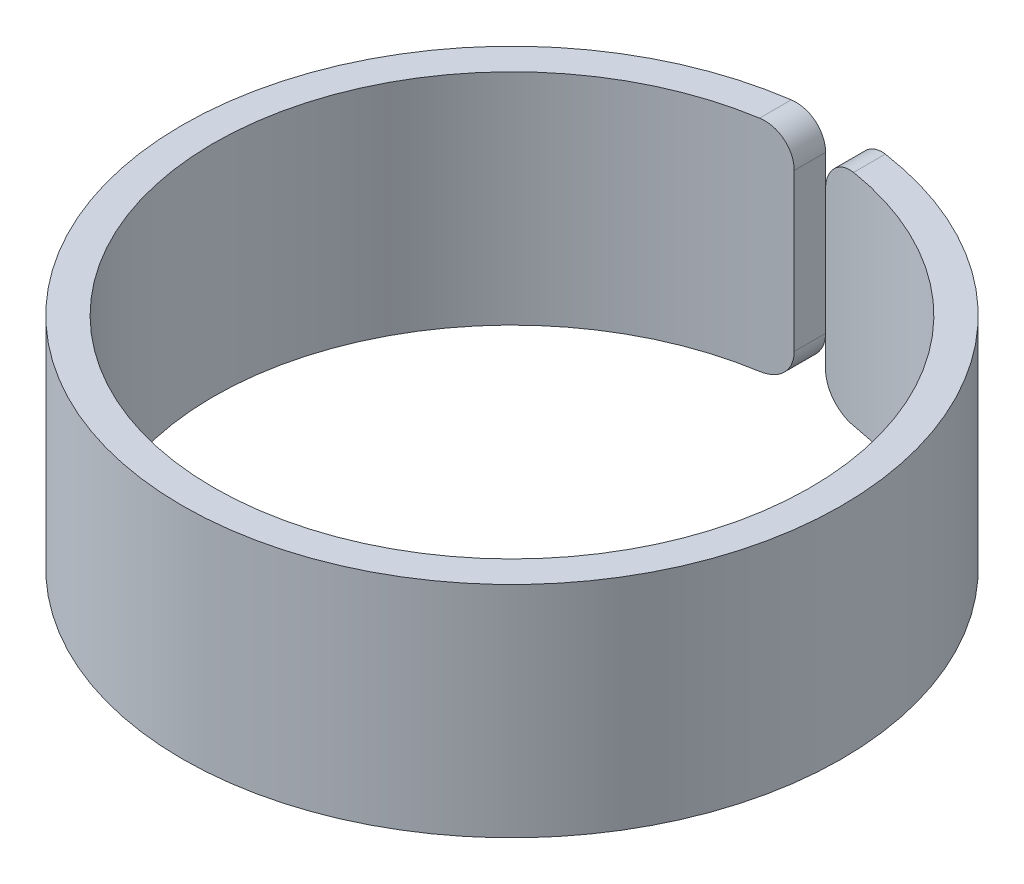
ISO-10303-21;
HEADER;
FILE_DESCRIPTION(('STEP AP214'),'2;1');
FILE_NAME('part.step','',(''),(''),'','','');
FILE_SCHEMA(('AUTOMOTIVE_DESIGN { 1 0 10303 214 1 1 1 1 }'));
ENDSEC;
DATA;
#1=APPLICATION_CONTEXT('core data for automotive mechanical design processes');
#2=APPLICATION_PROTOCOL_DEFINITION('international standard','automotive_design',2000,#1);
#3=PRODUCT_CONTEXT('',#1,'mechanical');
#4=PRODUCT('Part','Part','',(#3));
#5=PRODUCT_RELATED_PRODUCT_CATEGORY('part','',(#4));
#6=PRODUCT_DEFINITION_FORMATION('','',#4);
#7=PRODUCT_DEFINITION_CONTEXT('part definition',#1,'design');
#8=PRODUCT_DEFINITION('design','',#6,#7);
#9=PRODUCT_DEFINITION_SHAPE('','',#8);
#10=(LENGTH_UNIT() NAMED_UNIT(*) SI_UNIT(.MILLI.,.METRE.));
#11=(NAMED_UNIT(*) PLANE_ANGLE_UNIT() SI_UNIT($,.RADIAN.));
#12=(NAMED_UNIT(*) SI_UNIT($,.STERADIAN.) SOLID_ANGLE_UNIT());
#13=UNCERTAINTY_MEASURE_WITH_UNIT(LENGTH_MEASURE(1.E-05),#10,'distance_accuracy_value','');
#14=(GEOMETRIC_REPRESENTATION_CONTEXT(3) GLOBAL_UNCERTAINTY_ASSIGNED_CONTEXT((#13)) GLOBAL_UNIT_ASSIGNED_CONTEXT((#10,
#11,#12)) REPRESENTATION_CONTEXT('',''));
#15=CARTESIAN_POINT('',(0.,0.,0.));
#16=DIRECTION('',(0.,0.,1.));
#17=DIRECTION('',(1.,0.,0.));
#18=AXIS2_PLACEMENT_3D('',#15,#16,#17);
#19=CARTESIAN_POINT('',(0.,3.5,0.));
#20=DIRECTION('',(0.,1.,0.));
#21=DIRECTION('',(0.,0.,1.));
#22=AXIS2_PLACEMENT_3D('',#19,#20,#21);
#23=PLANE('',#22);
#24=CARTESIAN_POINT('',(0.,3.5,0.));
#25=DIRECTION('',(0.,1.,0.));
#26=DIRECTION('',(1.,0.,0.));
#27=AXIS2_PLACEMENT_3D('',#24,#25,#26);
#28=CIRCLE('',#27,10.52);
#29=CARTESIAN_POINT('',(-1.50000000000031,3.5,-10.4125117046752));
#30=VERTEX_POINT('',#29);
#31=CARTESIAN_POINT('',(1.5000000000003,3.5,-10.4125117046753));
#32=VERTEX_POINT('',#31);
#33=EDGE_CURVE('E212',#30,#32,#28,.T.);
#34=ORIENTED_EDGE('',*,*,#33,.T.);
#35=DIRECTION('',(0.,0.,-1.));
#36=VECTOR('',#35,1.);
#37=CARTESIAN_POINT('',(1.5000000000003,3.5,-9.50686068058219));
#38=LINE('',#37,#36);
#39=CARTESIAN_POINT('',(1.5000000000003,3.5,-9.40108504375953));
#40=VERTEX_POINT('',#39);
#41=EDGE_CURVE('E130',#32,#40,#38,.F.);
#42=ORIENTED_EDGE('',*,*,#41,.T.);
#43=CARTESIAN_POINT('',(0.,3.5,0.));
#44=DIRECTION('',(0.,1.,0.));
#45=DIRECTION('',(0.,0.,1.));
#46=AXIS2_PLACEMENT_3D('',#43,#44,#45);
#47=CIRCLE('',#46,9.52);
#48=CARTESIAN_POINT('',(-1.50000000000031,3.5,-9.40108504375953));
#49=VERTEX_POINT('',#48);
#50=EDGE_CURVE('E216',#49,#40,#47,.T.);
#51=ORIENTED_EDGE('',*,*,#50,.F.);
#52=DIRECTION('',(0.,0.,1.));
#53=VECTOR('',#52,1.);
#54=CARTESIAN_POINT('',(-1.50000000000031,3.5,-10.508111152819));
#55=LINE('',#54,#53);
#56=EDGE_CURVE('E133',#49,#30,#55,.F.);
#57=ORIENTED_EDGE('',*,*,#56,.T.);
#58=EDGE_LOOP('',(#34,#42,#51,#57));
#59=FACE_BOUND('',#58,.T.);
#60=ADVANCED_FACE('F39',(#59),#23,.T.);
#61=CARTESIAN_POINT('',(0.,-3.5,0.));
#62=DIRECTION('',(0.,1.,0.));
#63=DIRECTION('',(0.,0.,1.));
#64=AXIS2_PLACEMENT_3D('',#61,#62,#63);
#65=PLANE('',#64);
#66=CARTESIAN_POINT('',(0.,-3.5,0.));
#67=DIRECTION('',(0.,1.,0.));
#68=DIRECTION('',(1.,0.,0.));
#69=AXIS2_PLACEMENT_3D('',#66,#67,#68);
#70=CIRCLE('',#69,10.52);
#71=CARTESIAN_POINT('',(-1.50000000000031,-3.5,-10.4125117046752));
#72=VERTEX_POINT('',#71);
#73=CARTESIAN_POINT('',(1.5000000000003,-3.5,-10.4125117046753));
#74=VERTEX_POINT('',#73);
#75=EDGE_CURVE('E213',#72,#74,#70,.T.);
#76=ORIENTED_EDGE('',*,*,#75,.F.);
#77=DIRECTION('',(0.,0.,1.));
#78=VECTOR('',#77,1.);
#79=CARTESIAN_POINT('',(-1.50000000000031,-3.5,0.));
#80=LINE('',#79,#78);
#81=CARTESIAN_POINT('',(-1.50000000000031,-3.5,-9.40108504375953));
#82=VERTEX_POINT('',#81);
#83=EDGE_CURVE('E12',#72,#82,#80,.T.);
#84=ORIENTED_EDGE('',*,*,#83,.T.);
#85=CARTESIAN_POINT('',(0.,-3.5,0.));
#86=DIRECTION('',(0.,1.,0.));
#87=DIRECTION('',(0.,0.,1.));
#88=AXIS2_PLACEMENT_3D('',#85,#86,#87);
#89=CIRCLE('',#88,9.52);
#90=CARTESIAN_POINT('',(1.5000000000003,-3.5,-9.40108504375953));
#91=VERTEX_POINT('',#90);
#92=EDGE_CURVE('E219',#82,#91,#89,.T.);
#93=ORIENTED_EDGE('',*,*,#92,.T.);
#94=DIRECTION('',(0.,0.,-1.));
#95=VECTOR('',#94,1.);
#96=CARTESIAN_POINT('',(1.50000000000031,-3.5,0.));
#97=LINE('',#96,#95);
#98=EDGE_CURVE('E48',#91,#74,#97,.T.);
#99=ORIENTED_EDGE('',*,*,#98,.T.);
#100=EDGE_LOOP('',(#76,#84,#93,#99));
#101=FACE_BOUND('',#100,.T.);
#102=ADVANCED_FACE('F199',(#101),#65,.F.);
#103=CARTESIAN_POINT('',(0.,3.5,0.));
#104=DIRECTION('',(0.,-1.,0.));
#105=DIRECTION('',(0.,0.,-1.));
#106=AXIS2_PLACEMENT_3D('',#103,#104,#105);
#107=CYLINDRICAL_SURFACE('',#106,10.52);
#108=DIRECTION('',(0.,-1.,0.));
#109=VECTOR('',#108,1.);
#110=CARTESIAN_POINT('',(0.5000000000003,3.5,-10.508111152819));
#111=LINE('',#110,#109);
#112=CARTESIAN_POINT('',(0.5000000000003,-2.5,-10.508111152819));
#113=VERTEX_POINT('',#112);
#114=CARTESIAN_POINT('',(0.5000000000003,2.5,-10.508111152819));
#115=VERTEX_POINT('',#114);
#116=EDGE_CURVE('E115',#113,#115,#111,.F.);
#117=ORIENTED_EDGE('',*,*,#116,.T.);
#118=CARTESIAN_POINT('',(0.5000000000003,2.5,-10.508111152819));
#119=CARTESIAN_POINT('',(0.500000173990326,2.52809536959546,-10.5081104957995));
#120=CARTESIAN_POINT('',(0.50118477079039,2.55617728696343,-10.5080548516909));
#121=CARTESIAN_POINT('',(0.505910520132688,2.61214033083627,-10.5078286433341));
#122=CARTESIAN_POINT('',(0.509451564700855,2.64002146648192,-10.5076580843515));
#123=CARTESIAN_POINT('',(0.523575752913995,2.72301658233977,-10.5069673600802));
#124=CARTESIAN_POINT('',(0.537660043740329,2.77757487707505,-10.5062681769172));
#125=CARTESIAN_POINT('',(0.574771226854076,2.88354863395968,-10.5043028925258));
#126=CARTESIAN_POINT('',(0.597802532849772,2.93496253041448,-10.5030365114421));
#127=CARTESIAN_POINT('',(0.652142880536923,3.03318464057714,-10.499802261567));
#128=CARTESIAN_POINT('',(0.683450415822341,3.07999369031538,-10.4978345204118));
#129=CARTESIAN_POINT('',(0.753421534574761,3.16765638102477,-10.4930444274093));
#130=CARTESIAN_POINT('',(0.792081571626897,3.2085128764478,-10.4902224871909));
#131=CARTESIAN_POINT('',(0.875652058716907,3.28315274296944,-10.4835769906622));
#132=CARTESIAN_POINT('',(0.920563424884361,3.31693507553193,-10.4797532874714));
#133=CARTESIAN_POINT('',(1.0153190059075,3.37647975816768,-10.4709975156382));
#134=CARTESIAN_POINT('',(1.06516339231255,3.40224182920129,-10.4660654084427));
#135=CARTESIAN_POINT('',(1.16833720494906,3.44504771725542,-10.4550501233979));
#136=CARTESIAN_POINT('',(1.22166511316152,3.46209530359082,-10.4489674447728));
#137=CARTESIAN_POINT('',(1.31274218081141,3.48303770009912,-10.4378390921893));
#138=CARTESIAN_POINT('',(1.3499802275045,3.48939993569244,-10.433089905788));
#139=CARTESIAN_POINT('',(1.4248179797192,3.4978806558238,-10.4231344616857));
#140=CARTESIAN_POINT('',(1.46241704982163,3.50000557316568,-10.417928909371));
#141=CARTESIAN_POINT('',(1.5000000000003,3.5,-10.4125117046753));
#142=B_SPLINE_CURVE_WITH_KNOTS('',3,(#118,#119,#120,#121,#122,#123,#124,#125,#126,#127,#128,
#129,#130,#131,#132,#133,#134,#135,#136,#137,#138,#139,#140,#141),.UNSPECIFIED.,.F.,.F.,(4,2,2,
2,2,2,2,2,2,2,2,4),(0.,0.0842343628520662,0.168464866293088,0.336651590809782,0.504921390154512,
0.673160582768882,0.841318831550482,1.00950174984776,1.1776905188846,1.34580647879851,
1.4598050602935,1.5736304448597),.UNSPECIFIED.);
#143=EDGE_CURVE('E186',#115,#32,#142,.T.);
#144=ORIENTED_EDGE('',*,*,#143,.T.);
#145=ORIENTED_EDGE('',*,*,#33,.F.);
#146=CARTESIAN_POINT('',(-1.50000000000031,3.5,-10.4125117046752));
#147=CARTESIAN_POINT('',(-1.47197265457512,3.49999973232898,-10.4165498820124));
#148=CARTESIAN_POINT('',(-1.44394159985791,3.49882092097969,-10.4204716754006));
#149=CARTESIAN_POINT('',(-1.38804366032391,3.49410934554469,-10.4280644719188));
#150=CARTESIAN_POINT('',(-1.36017677738775,3.49057655454644,-10.431735472181));
#151=CARTESIAN_POINT('',(-1.27715665719302,3.47646485907445,-10.4423354211473));
#152=CARTESIAN_POINT('',(-1.22250618779357,3.46237260530242,-10.4488624842294));
#153=CARTESIAN_POINT('',(-1.11622376238985,3.42514479316729,-10.4607511476611));
#154=CARTESIAN_POINT('',(-1.06459416203445,3.40200228274795,-10.4661118471167));
#155=CARTESIAN_POINT('',(-0.965898679891431,3.34729925560623,-10.4756812671342));
#156=CARTESIAN_POINT('',(-0.918831392157017,3.31574134353648,-10.47989034332));
#157=CARTESIAN_POINT('',(-0.830935285630264,3.24532135920653,-10.4872247799611));
#158=CARTESIAN_POINT('',(-0.790067869617737,3.20650814634923,-10.4903570132763));
#159=CARTESIAN_POINT('',(-0.71538926996337,3.12252971548472,-10.4957145296036));
#160=CARTESIAN_POINT('',(-0.681579622797911,3.07736311792037,-10.49793961523));
#161=CARTESIAN_POINT('',(-0.622085190865647,2.98209284935856,-10.5016331909484));
#162=CARTESIAN_POINT('',(-0.59638112446117,2.93200127242376,-10.5031034818715));
#163=CARTESIAN_POINT('',(-0.553736218454195,2.8282185376253,-10.5054383558279));
#164=CARTESIAN_POINT('',(-0.536790225121978,2.77452951775615,-10.5063032951896));
#165=CARTESIAN_POINT('',(-0.516332999567538,2.68376360545782,-10.5073244107504));
#166=CARTESIAN_POINT('',(-0.510211955242694,2.64725498778543,-10.5076216394351));
#167=CARTESIAN_POINT('',(-0.50204591392776,2.57383598672873,-10.5080138283005));
#168=CARTESIAN_POINT('',(-0.499995170382101,2.53692624384697,-10.5081090736594));
#169=CARTESIAN_POINT('',(-0.500000000000306,2.5,-10.508111152819));
#170=B_SPLINE_CURVE_WITH_KNOTS('',3,(#146,#147,#148,#149,#150,#151,#152,#153,#154,#155,#156,
#157,#158,#159,#160,#161,#162,#163,#164,#165,#166,#167,#168,#169),.UNSPECIFIED.,.F.,.F.,(4,2,2,
2,2,2,2,2,2,2,2,4),(0.,0.0848994596250283,0.169799889904256,0.339368051088577,0.509066724629099,
0.678712935539253,0.847255367679371,1.01583445333251,1.18400944222506,1.35208535474238,
1.4629315389816,1.57362111608515),.UNSPECIFIED.);
#171=CARTESIAN_POINT('',(-0.500000000000306,2.5,-10.508111152819));
#172=VERTEX_POINT('',#171);
#173=EDGE_CURVE('E179',#30,#172,#170,.T.);
#174=ORIENTED_EDGE('',*,*,#173,.T.);
#175=DIRECTION('',(0.,-1.,0.));
#176=VECTOR('',#175,1.);
#177=CARTESIAN_POINT('',(-0.500000000000306,3.5,-10.508111152819));
#178=LINE('',#177,#176);
#179=CARTESIAN_POINT('',(-0.500000000000306,-2.5,-10.508111152819));
#180=VERTEX_POINT('',#179);
#181=EDGE_CURVE('E223',#172,#180,#178,.T.);
#182=ORIENTED_EDGE('',*,*,#181,.T.);
#183=CARTESIAN_POINT('',(-0.500000000000306,-2.5,-10.508111152819));
#184=CARTESIAN_POINT('',(-0.500000173990332,-2.52809536959546,-10.5081104957995));
#185=CARTESIAN_POINT('',(-0.501184770790397,-2.55617728696343,-10.5080548516909));
#186=CARTESIAN_POINT('',(-0.505910520132695,-2.61214033083627,-10.5078286433341));
#187=CARTESIAN_POINT('',(-0.509451564700861,-2.64002146648192,-10.5076580843515));
#188=CARTESIAN_POINT('',(-0.523575752914001,-2.72301658233977,-10.5069673600802));
#189=CARTESIAN_POINT('',(-0.537660043740336,-2.77757487707505,-10.5062681769172));
#190=CARTESIAN_POINT('',(-0.574771226854082,-2.88354863395968,-10.5043028925258));
#191=CARTESIAN_POINT('',(-0.597802532849778,-2.93496253041448,-10.5030365114421));
#192=CARTESIAN_POINT('',(-0.65214288053693,-3.03318464057714,-10.499802261567));
#193=CARTESIAN_POINT('',(-0.683450415822347,-3.07999369031538,-10.4978345204118));
#194=CARTESIAN_POINT('',(-0.753421534574768,-3.16765638102477,-10.4930444274093));
#195=CARTESIAN_POINT('',(-0.792081571626903,-3.2085128764478,-10.4902224871909));
#196=CARTESIAN_POINT('',(-0.875652058716913,-3.28315274296944,-10.4835769906622));
#197=CARTESIAN_POINT('',(-0.920563424884367,-3.31693507553193,-10.4797532874714));
#198=CARTESIAN_POINT('',(-1.01531900590751,-3.37647975816768,-10.4709975156382));
#199=CARTESIAN_POINT('',(-1.06516339231256,-3.40224182920129,-10.4660654084427));
#200=CARTESIAN_POINT('',(-1.16833720494907,-3.44504771725542,-10.4550501233979));
#201=CARTESIAN_POINT('',(-1.22166511316153,-3.46209530359082,-10.4489674447728));
#202=CARTESIAN_POINT('',(-1.31274218081142,-3.48303770009912,-10.4378390921893));
#203=CARTESIAN_POINT('',(-1.34998022750451,-3.48939993569244,-10.433089905788));
#204=CARTESIAN_POINT('',(-1.4248179797192,-3.4978806558238,-10.4231344616857));
#205=CARTESIAN_POINT('',(-1.46241704982164,-3.50000557316568,-10.417928909371));
#206=CARTESIAN_POINT('',(-1.50000000000031,-3.5,-10.4125117046752));
#207=B_SPLINE_CURVE_WITH_KNOTS('',3,(#183,#184,#185,#186,#187,#188,#189,#190,#191,#192,#193,
#194,#195,#196,#197,#198,#199,#200,#201,#202,#203,#204,#205,#206),.UNSPECIFIED.,.F.,.F.,(4,2,2,
2,2,2,2,2,2,2,2,4),(0.,0.0842343628520662,0.168464866293088,0.336651590809782,0.504921390154512,
0.673160582768882,0.841318831550482,1.00950174984776,1.1776905188846,1.34580647879851,
1.4598050602935,1.5736304448597),.UNSPECIFIED.);
#208=EDGE_CURVE('E187',#180,#72,#207,.T.);
#209=ORIENTED_EDGE('',*,*,#208,.T.);
#210=ORIENTED_EDGE('',*,*,#75,.T.);
#211=CARTESIAN_POINT('',(1.5000000000003,-3.5,-10.4125117046753));
#212=CARTESIAN_POINT('',(1.47197265457511,-3.49999973232898,-10.4165498820124));
#213=CARTESIAN_POINT('',(1.4439415998579,-3.49882092097969,-10.4204716754006));
#214=CARTESIAN_POINT('',(1.38804366032391,-3.49410934554469,-10.4280644719188));
#215=CARTESIAN_POINT('',(1.36017677738774,-3.49057655454644,-10.431735472181));
#216=CARTESIAN_POINT('',(1.27715665719302,-3.47646485907445,-10.4423354211473));
#217=CARTESIAN_POINT('',(1.22250618779357,-3.46237260530242,-10.4488624842294));
#218=CARTESIAN_POINT('',(1.11622376238984,-3.42514479316729,-10.4607511476611));
#219=CARTESIAN_POINT('',(1.06459416203445,-3.40200228274795,-10.4661118471167));
#220=CARTESIAN_POINT('',(0.965898679891424,-3.34729925560623,-10.4756812671342));
#221=CARTESIAN_POINT('',(0.918831392157011,-3.31574134353648,-10.47989034332));
#222=CARTESIAN_POINT('',(0.830935285630257,-3.24532135920653,-10.4872247799611));
#223=CARTESIAN_POINT('',(0.790067869617731,-3.20650814634923,-10.4903570132763));
#224=CARTESIAN_POINT('',(0.715389269963364,-3.12252971548472,-10.4957145296036));
#225=CARTESIAN_POINT('',(0.681579622797904,-3.07736311792037,-10.49793961523));
#226=CARTESIAN_POINT('',(0.62208519086564,-2.98209284935856,-10.5016331909484));
#227=CARTESIAN_POINT('',(0.596381124461163,-2.93200127242376,-10.5031034818715));
#228=CARTESIAN_POINT('',(0.553736218454188,-2.8282185376253,-10.5054383558279));
#229=CARTESIAN_POINT('',(0.536790225121972,-2.77452951775615,-10.5063032951896));
#230=CARTESIAN_POINT('',(0.516332999567532,-2.68376360545782,-10.5073244107504));
#231=CARTESIAN_POINT('',(0.510211955242687,-2.64725498778543,-10.5076216394351));
#232=CARTESIAN_POINT('',(0.502045913927754,-2.57383598672873,-10.5080138283005));
#233=CARTESIAN_POINT('',(0.499995170382094,-2.53692624384697,-10.5081090736594));
#234=CARTESIAN_POINT('',(0.5000000000003,-2.5,-10.508111152819));
#235=B_SPLINE_CURVE_WITH_KNOTS('',3,(#211,#212,#213,#214,#215,#216,#217,#218,#219,#220,#221,
#222,#223,#224,#225,#226,#227,#228,#229,#230,#231,#232,#233,#234),.UNSPECIFIED.,.F.,.F.,(4,2,2,
2,2,2,2,2,2,2,2,4),(0.,0.0848994596250285,0.169799889904256,0.339368051088576,0.509066724629099,
0.678712935539252,0.847255367679371,1.01583445333251,1.18400944222505,1.35208535474238,
1.4629315389816,1.57362111608515),.UNSPECIFIED.);
#236=EDGE_CURVE('E203',#74,#113,#235,.T.);
#237=ORIENTED_EDGE('',*,*,#236,.T.);
#238=EDGE_LOOP('',(#117,#144,#145,#174,#182,#209,#210,#237));
#239=FACE_BOUND('',#238,.T.);
#240=ADVANCED_FACE('F151',(#239),#107,.T.);
#241=CARTESIAN_POINT('',(0.,3.5,0.));
#242=DIRECTION('',(0.,-1.,0.));
#243=DIRECTION('',(0.,0.,-1.));
#244=AXIS2_PLACEMENT_3D('',#241,#242,#243);
#245=CYLINDRICAL_SURFACE('',#244,9.52);
#246=ORIENTED_EDGE('',*,*,#50,.T.);
#247=CARTESIAN_POINT('',(1.5000000000003,3.5,-9.40108504375953));
#248=CARTESIAN_POINT('',(1.47199677303183,3.49999971433518,-9.40555382240553));
#249=CARTESIAN_POINT('',(1.44398598207418,3.49882294015936,-9.40989394594485));
#250=CARTESIAN_POINT('',(1.38812026847763,3.494117522812,-9.41829699704047));
#251=CARTESIAN_POINT('',(1.36026534967951,3.49058882194257,-9.42235991779369));
#252=CARTESIAN_POINT('',(1.27726542534573,3.47648888560176,-9.43409248447784));
#253=CARTESIAN_POINT('',(1.22261108648228,3.46240380165521,-9.44131773061909));
#254=CARTESIAN_POINT('',(1.11629179112244,3.42517417126421,-9.45447898043035));
#255=CARTESIAN_POINT('',(1.06462936561398,3.40202207952983,-9.46041390391927));
#256=CARTESIAN_POINT('',(0.965857718817786,3.34727626793151,-9.47100765448021));
#257=CARTESIAN_POINT('',(0.91874695978432,3.31568541271455,-9.47566691350813));
#258=CARTESIAN_POINT('',(0.830830548569319,3.24522578840739,-9.48377871625761));
#259=CARTESIAN_POINT('',(0.789977737925819,3.20641688988944,-9.48724056100513));
#260=CARTESIAN_POINT('',(0.715320484869371,3.12244224374008,-9.4931618915893));
#261=CARTESIAN_POINT('',(0.681517611809031,3.07727508446697,-9.49562115436209));
#262=CARTESIAN_POINT('',(0.622051389489133,2.98202746224521,-9.49970216075697));
#263=CARTESIAN_POINT('',(0.596364165700131,2.93196198912403,-9.50132636994343));
#264=CARTESIAN_POINT('',(0.553742896090012,2.82823280283998,-9.50390590422466));
#265=CARTESIAN_POINT('',(0.536803697681401,2.77457122887336,-9.50486162317808));
#266=CARTESIAN_POINT('',(0.516343514943428,2.68382218383793,-9.50599050849826));
#267=CARTESIAN_POINT('',(0.510218558365502,2.64730228003168,-9.50631925819737));
#268=CARTESIAN_POINT('',(0.502047241662855,2.57385998597138,-9.50675303579657));
#269=CARTESIAN_POINT('',(0.499995138323631,2.53693823639733,-9.50685837874153));
#270=CARTESIAN_POINT('',(0.5000000000003,2.5,-9.50686068058219));
#271=B_SPLINE_CURVE_WITH_KNOTS('',3,(#247,#248,#249,#250,#251,#252,#253,#254,#255,#256,#257,
#258,#259,#260,#261,#262,#263,#264,#265,#266,#267,#268,#269,#270),.UNSPECIFIED.,.F.,.F.,(4,2,2,
2,2,2,2,2,2,2,2,4),(0.,0.0850220512605754,0.170046188374375,0.339872009556188,0.509839455984887,
0.679749277934872,0.848307999356518,1.01690420286758,1.18499971142778,1.35299609847805,
1.46387806436572,1.57460356189696),.UNSPECIFIED.);
#272=CARTESIAN_POINT('',(0.5000000000003,2.5,-9.50686068058219));
#273=VERTEX_POINT('',#272);
#274=EDGE_CURVE('E125',#40,#273,#271,.T.);
#275=ORIENTED_EDGE('',*,*,#274,.T.);
#276=DIRECTION('',(0.,-1.,0.));
#277=VECTOR('',#276,1.);
#278=CARTESIAN_POINT('',(0.5000000000003,3.5,-9.50686068058219));
#279=LINE('',#278,#277);
#280=CARTESIAN_POINT('',(0.5000000000003,-2.5,-9.50686068058219));
#281=VERTEX_POINT('',#280);
#282=EDGE_CURVE('E112',#281,#273,#279,.F.);
#283=ORIENTED_EDGE('',*,*,#282,.F.);
#284=CARTESIAN_POINT('',(0.5000000000003,-2.5,-9.50686068058219));
#285=CARTESIAN_POINT('',(0.500000171096959,-2.52808665425604,-9.50685995507074));
#286=CARTESIAN_POINT('',(0.501184036583387,-2.55615986215027,-9.50679848846242));
#287=CARTESIAN_POINT('',(0.505906848738359,-2.61210558455799,-9.50654861167136));
#288=CARTESIAN_POINT('',(0.509445688618897,-2.63997810811372,-9.50636020724469));
#289=CARTESIAN_POINT('',(0.52356107772642,-2.7229479060612,-9.50559721463555));
#290=CARTESIAN_POINT('',(0.537636588893777,-2.77748972018439,-9.5048248795509));
#291=CARTESIAN_POINT('',(0.574723913756437,-2.88343170717494,-9.50265401976755));
#292=CARTESIAN_POINT('',(0.59774016480277,-2.93483030535858,-9.50125518407945));
#293=CARTESIAN_POINT('',(0.652042620411759,-3.03302283531136,-9.4976827612696));
#294=CARTESIAN_POINT('',(0.683327309251953,-3.07981760887189,-9.49550931611938));
#295=CARTESIAN_POINT('',(0.753238251210817,-3.16744850284497,-9.49021899214789));
#296=CARTESIAN_POINT('',(0.791860197142396,-3.20828809438805,-9.48710266619268));
#297=CARTESIAN_POINT('',(0.875336990938141,-3.28289823347776,-9.47976459055478));
#298=CARTESIAN_POINT('',(0.920192685977195,-3.31666781863488,-9.47554269055401));
#299=CARTESIAN_POINT('',(1.01481229830503,-3.37619532305367,-9.46587636163995));
#300=CARTESIAN_POINT('',(1.06457620117651,-3.40195326584772,-9.46043193631763));
#301=CARTESIAN_POINT('',(1.16756264047528,-3.44477065613896,-9.44827389474591));
#302=CARTESIAN_POINT('',(1.22078378807674,-3.4618335724889,-9.4415607861012));
#303=CARTESIAN_POINT('',(1.31191369621723,-3.48288668284156,-9.42924582031797));
#304=CARTESIAN_POINT('',(1.34932437513909,-3.48930677885924,-9.42396696708605));
#305=CARTESIAN_POINT('',(1.42449842298771,-3.49786303522818,-9.41289867027298));
#306=CARTESIAN_POINT('',(1.46226115937551,-3.5000057837486,-9.4071100262782));
#307=CARTESIAN_POINT('',(1.5000000000003,-3.5,-9.40108504375953));
#308=B_SPLINE_CURVE_WITH_KNOTS('',3,(#284,#285,#286,#287,#288,#289,#290,#291,#292,#293,#294,
#295,#296,#297,#298,#299,#300,#301,#302,#303,#304,#305,#306,#307),.UNSPECIFIED.,.F.,.F.,(4,2,2,
2,2,2,2,2,2,2,2,4),(0.,0.0842082384023327,0.168412658581718,0.33654808448608,0.50476706400077,
0.672955227942175,0.841044963840047,1.00915756573852,1.17726967383985,1.34531466154826,
1.46005322621478,1.57461492843606),.UNSPECIFIED.);
#309=EDGE_CURVE('E122',#281,#91,#308,.T.);
#310=ORIENTED_EDGE('',*,*,#309,.T.);
#311=ORIENTED_EDGE('',*,*,#92,.F.);
#312=CARTESIAN_POINT('',(-1.50000000000031,-3.5,-9.40108504375953));
#313=CARTESIAN_POINT('',(-1.47199677303183,-3.49999971433518,-9.40555382240553));
#314=CARTESIAN_POINT('',(-1.44398598207419,-3.49882294015936,-9.40989394594485));
#315=CARTESIAN_POINT('',(-1.38812026847764,-3.494117522812,-9.41829699704047));
#316=CARTESIAN_POINT('',(-1.36026534967952,-3.49058882194257,-9.42235991779369));
#317=CARTESIAN_POINT('',(-1.27726542534573,-3.47648888560176,-9.43409248447784));
#318=CARTESIAN_POINT('',(-1.22261108648228,-3.46240380165521,-9.44131773061909));
#319=CARTESIAN_POINT('',(-1.11629179112244,-3.42517417126421,-9.45447898043035));
#320=CARTESIAN_POINT('',(-1.06462936561399,-3.40202207952983,-9.46041390391927));
#321=CARTESIAN_POINT('',(-0.965857718817791,-3.34727626793151,-9.47100765448021));
#322=CARTESIAN_POINT('',(-0.918746959784326,-3.31568541271455,-9.47566691350812));
#323=CARTESIAN_POINT('',(-0.830830548569325,-3.24522578840739,-9.48377871625761));
#324=CARTESIAN_POINT('',(-0.789977737925825,-3.20641688988944,-9.48724056100512));
#325=CARTESIAN_POINT('',(-0.715320484869377,-3.12244224374008,-9.4931618915893));
#326=CARTESIAN_POINT('',(-0.681517611809037,-3.07727508446697,-9.49562115436209));
#327=CARTESIAN_POINT('',(-0.62205138948914,-2.98202746224521,-9.49970216075697));
#328=CARTESIAN_POINT('',(-0.596364165700138,-2.93196198912403,-9.50132636994343));
#329=CARTESIAN_POINT('',(-0.553742896090018,-2.82823280283998,-9.50390590422466));
#330=CARTESIAN_POINT('',(-0.536803697681407,-2.77457122887336,-9.50486162317808));
#331=CARTESIAN_POINT('',(-0.516343514943434,-2.68382218383793,-9.50599050849826));
#332=CARTESIAN_POINT('',(-0.510218558365507,-2.64730228003168,-9.50631925819737));
#333=CARTESIAN_POINT('',(-0.502047241662861,-2.57385998597138,-9.50675303579657));
#334=CARTESIAN_POINT('',(-0.499995138323636,-2.53693823639733,-9.50685837874153));
#335=CARTESIAN_POINT('',(-0.500000000000306,-2.5,-9.50686068058219));
#336=B_SPLINE_CURVE_WITH_KNOTS('',3,(#312,#313,#314,#315,#316,#317,#318,#319,#320,#321,#322,
#323,#324,#325,#326,#327,#328,#329,#330,#331,#332,#333,#334,#335),.UNSPECIFIED.,.F.,.F.,(4,2,2,
2,2,2,2,2,2,2,2,4),(0.,0.0850220512605754,0.170046188374376,0.339872009556188,0.509839455984887,
0.679749277934873,0.848307999356518,1.01690420286758,1.18499971142778,1.35299609847805,
1.46387806436572,1.57460356189696),.UNSPECIFIED.);
#337=CARTESIAN_POINT('',(-0.500000000000306,-2.5,-9.50686068058219));
#338=VERTEX_POINT('',#337);
#339=EDGE_CURVE('E55',#82,#338,#336,.T.);
#340=ORIENTED_EDGE('',*,*,#339,.T.);
#341=DIRECTION('',(0.,-1.,0.));
#342=VECTOR('',#341,1.);
#343=CARTESIAN_POINT('',(-0.500000000000306,3.5,-9.50686068058219));
#344=LINE('',#343,#342);
#345=CARTESIAN_POINT('',(-0.500000000000306,2.5,-9.50686068058219));
#346=VERTEX_POINT('',#345);
#347=EDGE_CURVE('E126',#346,#338,#344,.T.);
#348=ORIENTED_EDGE('',*,*,#347,.F.);
#349=CARTESIAN_POINT('',(-0.500000000000306,2.5,-9.50686068058219));
#350=CARTESIAN_POINT('',(-0.500000171096965,2.52808665425604,-9.50685995507074));
#351=CARTESIAN_POINT('',(-0.501184036583393,2.55615986215027,-9.50679848846242));
#352=CARTESIAN_POINT('',(-0.505906848738365,2.61210558455799,-9.50654861167136));
#353=CARTESIAN_POINT('',(-0.509445688618903,2.63997810811372,-9.50636020724469));
#354=CARTESIAN_POINT('',(-0.523561077726426,2.7229479060612,-9.50559721463555));
#355=CARTESIAN_POINT('',(-0.537636588893783,2.77748972018439,-9.5048248795509));
#356=CARTESIAN_POINT('',(-0.574723913756443,2.88343170717494,-9.50265401976755));
#357=CARTESIAN_POINT('',(-0.597740164802776,2.93483030535858,-9.50125518407945));
#358=CARTESIAN_POINT('',(-0.652042620411765,3.03302283531136,-9.4976827612696));
#359=CARTESIAN_POINT('',(-0.683327309251959,3.07981760887189,-9.49550931611937));
#360=CARTESIAN_POINT('',(-0.753238251210823,3.16744850284497,-9.49021899214788));
#361=CARTESIAN_POINT('',(-0.791860197142402,3.20828809438805,-9.48710266619267));
#362=CARTESIAN_POINT('',(-0.875336990938146,3.28289823347776,-9.47976459055477));
#363=CARTESIAN_POINT('',(-0.920192685977201,3.31666781863488,-9.47554269055401));
#364=CARTESIAN_POINT('',(-1.01481229830504,3.37619532305367,-9.46587636163995));
#365=CARTESIAN_POINT('',(-1.06457620117651,3.40195326584772,-9.46043193631763));
#366=CARTESIAN_POINT('',(-1.16756264047529,3.44477065613896,-9.44827389474591));
#367=CARTESIAN_POINT('',(-1.22078378807675,3.4618335724889,-9.4415607861012));
#368=CARTESIAN_POINT('',(-1.31191369621723,3.48288668284156,-9.42924582031797));
#369=CARTESIAN_POINT('',(-1.3493243751391,3.48930677885924,-9.42396696708605));
#370=CARTESIAN_POINT('',(-1.42449842298772,3.49786303522818,-9.41289867027298));
#371=CARTESIAN_POINT('',(-1.46226115937551,3.5000057837486,-9.4071100262782));
#372=CARTESIAN_POINT('',(-1.50000000000031,3.5,-9.40108504375953));
#373=B_SPLINE_CURVE_WITH_KNOTS('',3,(#349,#350,#351,#352,#353,#354,#355,#356,#357,#358,#359,
#360,#361,#362,#363,#364,#365,#366,#367,#368,#369,#370,#371,#372),.UNSPECIFIED.,.F.,.F.,(4,2,2,
2,2,2,2,2,2,2,2,4),(0.,0.0842082384023327,0.168412658581718,0.33654808448608,0.50476706400077,
0.672955227942175,0.841044963840047,1.00915756573852,1.17726967383985,1.34531466154826,
1.46005322621478,1.57461492843606),.UNSPECIFIED.);
#374=EDGE_CURVE('E63',#346,#49,#373,.T.);
#375=ORIENTED_EDGE('',*,*,#374,.T.);
#376=EDGE_LOOP('',(#246,#275,#283,#310,#311,#340,#348,#375));
#377=FACE_BOUND('',#376,.T.);
#378=ADVANCED_FACE('F121',(#377),#245,.F.);
#379=CARTESIAN_POINT('',(-0.500000000000306,-3.5,0.));
#380=DIRECTION('',(-1.,0.,0.));
#381=DIRECTION('',(0.,0.,1.));
#382=AXIS2_PLACEMENT_3D('',#379,#380,#381);
#383=PLANE('',#382);
#384=ORIENTED_EDGE('',*,*,#181,.F.);
#385=DIRECTION('',(0.,0.,1.));
#386=VECTOR('',#385,1.);
#387=CARTESIAN_POINT('',(-0.500000000000306,2.5,-9.50686068058219));
#388=LINE('',#387,#386);
#389=EDGE_CURVE('E240',#172,#346,#388,.T.);
#390=ORIENTED_EDGE('',*,*,#389,.T.);
#391=ORIENTED_EDGE('',*,*,#347,.T.);
#392=DIRECTION('',(0.,0.,1.));
#393=VECTOR('',#392,1.);
#394=CARTESIAN_POINT('',(-0.500000000000306,-2.5,0.));
#395=LINE('',#394,#393);
#396=EDGE_CURVE('E234',#338,#180,#395,.F.);
#397=ORIENTED_EDGE('',*,*,#396,.T.);
#398=EDGE_LOOP('',(#384,#390,#391,#397));
#399=FACE_BOUND('',#398,.T.);
#400=ADVANCED_FACE('F150',(#399),#383,.F.);
#401=CARTESIAN_POINT('',(0.500000000000306,-3.5,0.));
#402=DIRECTION('',(1.,0.,0.));
#403=DIRECTION('',(0.,0.,-1.));
#404=AXIS2_PLACEMENT_3D('',#401,#402,#403);
#405=PLANE('',#404);
#406=ORIENTED_EDGE('',*,*,#282,.T.);
#407=DIRECTION('',(0.,0.,-1.));
#408=VECTOR('',#407,1.);
#409=CARTESIAN_POINT('',(0.5000000000003,2.5,-10.508111152819));
#410=LINE('',#409,#408);
#411=EDGE_CURVE('E118',#273,#115,#410,.T.);
#412=ORIENTED_EDGE('',*,*,#411,.T.);
#413=ORIENTED_EDGE('',*,*,#116,.F.);
#414=DIRECTION('',(0.,0.,-1.));
#415=VECTOR('',#414,1.);
#416=CARTESIAN_POINT('',(0.500000000000306,-2.5,0.));
#417=LINE('',#416,#415);
#418=EDGE_CURVE('E108',#113,#281,#417,.F.);
#419=ORIENTED_EDGE('',*,*,#418,.T.);
#420=EDGE_LOOP('',(#406,#412,#413,#419));
#421=FACE_BOUND('',#420,.T.);
#422=ADVANCED_FACE('F110',(#421),#405,.F.);
#423=CARTESIAN_POINT('',(1.50000000000031,2.5,0.));
#424=DIRECTION('',(0.,0.,1.));
#425=DIRECTION('',(1.,0.,0.));
#426=AXIS2_PLACEMENT_3D('',#423,#424,#425);
#427=CYLINDRICAL_SURFACE('',#426,1.);
#428=ORIENTED_EDGE('',*,*,#274,.F.);
#429=ORIENTED_EDGE('',*,*,#41,.F.);
#430=ORIENTED_EDGE('',*,*,#143,.F.);
#431=ORIENTED_EDGE('',*,*,#411,.F.);
#432=EDGE_LOOP('',(#428,#429,#430,#431));
#433=FACE_BOUND('',#432,.T.);
#434=ADVANCED_FACE('F173',(#433),#427,.T.);
#435=CARTESIAN_POINT('',(-1.50000000000031,2.5,0.));
#436=DIRECTION('',(0.,0.,-1.));
#437=DIRECTION('',(-1.,0.,0.));
#438=AXIS2_PLACEMENT_3D('',#435,#436,#437);
#439=CYLINDRICAL_SURFACE('',#438,1.);
#440=ORIENTED_EDGE('',*,*,#173,.F.);
#441=ORIENTED_EDGE('',*,*,#56,.F.);
#442=ORIENTED_EDGE('',*,*,#374,.F.);
#443=ORIENTED_EDGE('',*,*,#389,.F.);
#444=EDGE_LOOP('',(#440,#441,#442,#443));
#445=FACE_BOUND('',#444,.T.);
#446=ADVANCED_FACE('F169',(#445),#439,.T.);
#447=CARTESIAN_POINT('',(-1.50000000000031,-2.5,0.));
#448=DIRECTION('',(0.,0.,1.));
#449=DIRECTION('',(1.,0.,0.));
#450=AXIS2_PLACEMENT_3D('',#447,#448,#449);
#451=CYLINDRICAL_SURFACE('',#450,1.);
#452=ORIENTED_EDGE('',*,*,#208,.F.);
#453=ORIENTED_EDGE('',*,*,#396,.F.);
#454=ORIENTED_EDGE('',*,*,#339,.F.);
#455=ORIENTED_EDGE('',*,*,#83,.F.);
#456=EDGE_LOOP('',(#452,#453,#454,#455));
#457=FACE_BOUND('',#456,.T.);
#458=ADVANCED_FACE('F172',(#457),#451,.T.);
#459=CARTESIAN_POINT('',(1.50000000000031,-2.5,0.));
#460=DIRECTION('',(0.,0.,-1.));
#461=DIRECTION('',(-1.,0.,0.));
#462=AXIS2_PLACEMENT_3D('',#459,#460,#461);
#463=CYLINDRICAL_SURFACE('',#462,1.);
#464=ORIENTED_EDGE('',*,*,#309,.F.);
#465=ORIENTED_EDGE('',*,*,#418,.F.);
#466=ORIENTED_EDGE('',*,*,#236,.F.);
#467=ORIENTED_EDGE('',*,*,#98,.F.);
#468=EDGE_LOOP('',(#464,#465,#466,#467));
#469=FACE_BOUND('',#468,.T.);
#470=ADVANCED_FACE('F41',(#469),#463,.T.);
#471=CLOSED_SHELL('',(#60,#102,#240,#378,#400,#422,#434,#446,#458,#470));
#472=MANIFOLD_SOLID_BREP('B2',#471);
#473=ADVANCED_BREP_SHAPE_REPRESENTATION('',(#18,#472),#14);
#474=SHAPE_DEFINITION_REPRESENTATION(#9,#473);
ENDSEC;
END-ISO-10303-21;
